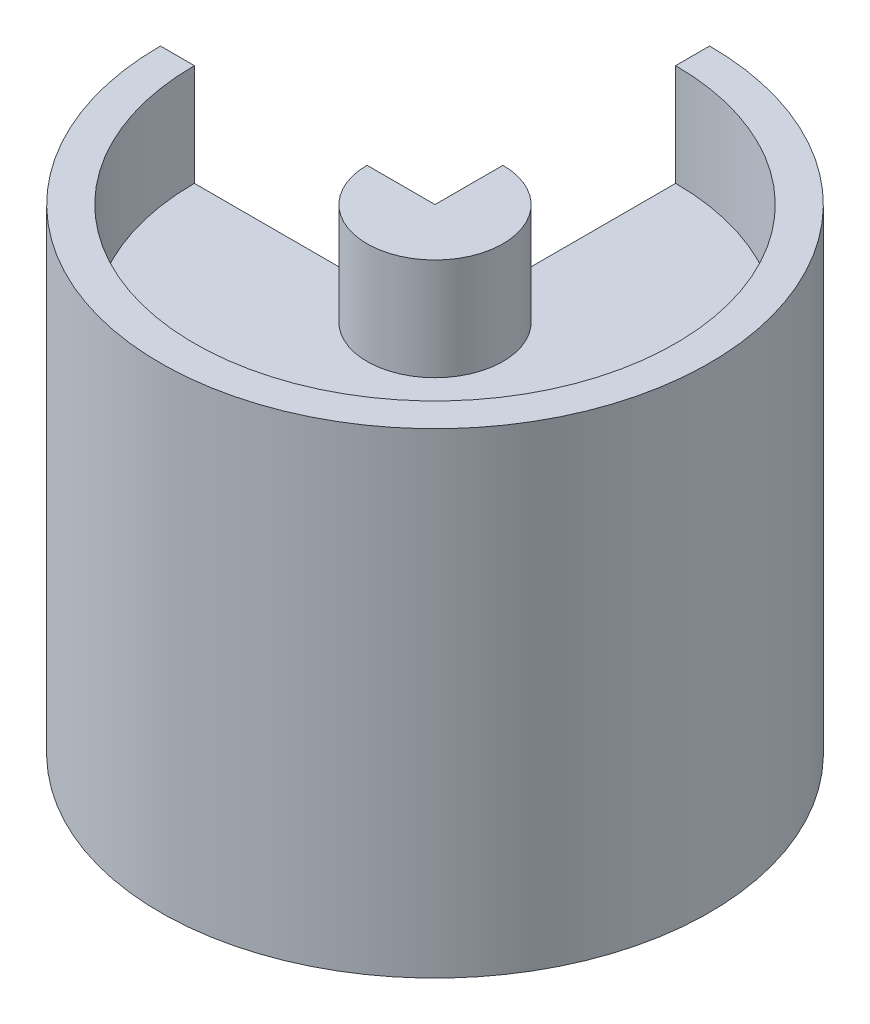
ISO-10303-21;
HEADER;
FILE_DESCRIPTION(('STEP AP214'),'2;1');
FILE_NAME('part.step','',(''),(''),'','','');
FILE_SCHEMA(('AUTOMOTIVE_DESIGN { 1 0 10303 214 1 1 1 1 }'));
ENDSEC;
DATA;
#1=APPLICATION_CONTEXT('core data for automotive mechanical design processes');
#2=APPLICATION_PROTOCOL_DEFINITION('international standard','automotive_design',2000,#1);
#3=PRODUCT_CONTEXT('',#1,'mechanical');
#4=PRODUCT('Part','Part','',(#3));
#5=PRODUCT_RELATED_PRODUCT_CATEGORY('part','',(#4));
#6=PRODUCT_DEFINITION_FORMATION('','',#4);
#7=PRODUCT_DEFINITION_CONTEXT('part definition',#1,'design');
#8=PRODUCT_DEFINITION('design','',#6,#7);
#9=PRODUCT_DEFINITION_SHAPE('','',#8);
#10=(LENGTH_UNIT() NAMED_UNIT(*) SI_UNIT(.MILLI.,.METRE.));
#11=(NAMED_UNIT(*) PLANE_ANGLE_UNIT() SI_UNIT($,.RADIAN.));
#12=(NAMED_UNIT(*) SI_UNIT($,.STERADIAN.) SOLID_ANGLE_UNIT());
#13=UNCERTAINTY_MEASURE_WITH_UNIT(LENGTH_MEASURE(1.E-05),#10,'distance_accuracy_value','');
#14=(GEOMETRIC_REPRESENTATION_CONTEXT(3) GLOBAL_UNCERTAINTY_ASSIGNED_CONTEXT((#13)) GLOBAL_UNIT_ASSIGNED_CONTEXT((#10,
#11,#12)) REPRESENTATION_CONTEXT('',''));
#15=CARTESIAN_POINT('',(0.,0.,0.));
#16=DIRECTION('',(0.,0.,1.));
#17=DIRECTION('',(1.,0.,0.));
#18=AXIS2_PLACEMENT_3D('',#15,#16,#17);
#19=CARTESIAN_POINT('',(-6.35,45.0234349741081,0.));
#20=DIRECTION('',(0.,-1.,0.));
#21=DIRECTION('',(0.,0.,-1.));
#22=AXIS2_PLACEMENT_3D('',#19,#20,#21);
#23=PLANE('',#22);
#24=DIRECTION('',(0.,0.,1.));
#25=VECTOR('',#24,1.);
#26=CARTESIAN_POINT('',(0.,45.0234349741081,-6.35));
#27=LINE('',#26,#25);
#28=CARTESIAN_POINT('',(0.,45.0234349741081,-6.35));
#29=VERTEX_POINT('',#28);
#30=CARTESIAN_POINT('',(0.,45.0234349741081,0.));
#31=VERTEX_POINT('',#30);
#32=EDGE_CURVE('E136',#29,#31,#27,.T.);
#33=ORIENTED_EDGE('',*,*,#32,.T.);
#34=DIRECTION('',(1.,0.,0.));
#35=VECTOR('',#34,1.);
#36=CARTESIAN_POINT('',(-6.35,45.0234349741081,0.));
#37=LINE('',#36,#35);
#38=CARTESIAN_POINT('',(-6.35,45.0234349741081,0.));
#39=VERTEX_POINT('',#38);
#40=EDGE_CURVE('E126',#39,#31,#37,.T.);
#41=ORIENTED_EDGE('',*,*,#40,.F.);
#42=CARTESIAN_POINT('',(0.,45.0234349741081,0.));
#43=DIRECTION('',(0.,1.,0.));
#44=DIRECTION('',(0.,0.,1.));
#45=AXIS2_PLACEMENT_3D('',#42,#43,#44);
#46=CIRCLE('',#45,6.35);
#47=EDGE_CURVE('E48',#39,#29,#46,.T.);
#48=ORIENTED_EDGE('',*,*,#47,.T.);
#49=EDGE_LOOP('',(#33,#41,#48));
#50=FACE_BOUND('',#49,.T.);
#51=ADVANCED_FACE('F33',(#50),#23,.F.);
#52=CARTESIAN_POINT('',(-3.17500000000001,0.57343497410807,0.));
#53=DIRECTION('',(0.,1.,0.));
#54=DIRECTION('',(0.,0.,1.));
#55=AXIS2_PLACEMENT_3D('',#52,#53,#54);
#56=PLANE('',#55);
#57=CARTESIAN_POINT('',(0.,0.57343497410807,0.));
#58=DIRECTION('',(0.,1.,0.));
#59=DIRECTION('',(0.,0.,1.));
#60=AXIS2_PLACEMENT_3D('',#57,#58,#59);
#61=CIRCLE('',#60,6.35);
#62=CARTESIAN_POINT('',(-6.35,0.57343497410807,0.));
#63=VERTEX_POINT('',#62);
#64=CARTESIAN_POINT('',(0.,0.57343497410807,-6.35));
#65=VERTEX_POINT('',#64);
#66=EDGE_CURVE('E11',#63,#65,#61,.T.);
#67=ORIENTED_EDGE('',*,*,#66,.F.);
#68=DIRECTION('',(-1.,0.,0.));
#69=VECTOR('',#68,1.);
#70=CARTESIAN_POINT('',(-3.17500000000001,0.57343497410807,0.));
#71=LINE('',#70,#69);
#72=CARTESIAN_POINT('',(0.,0.57343497410807,0.));
#73=VERTEX_POINT('',#72);
#74=EDGE_CURVE('E117',#73,#63,#71,.T.);
#75=ORIENTED_EDGE('',*,*,#74,.F.);
#76=DIRECTION('',(0.,0.,-1.));
#77=VECTOR('',#76,1.);
#78=CARTESIAN_POINT('',(0.,0.57343497410807,-3.17500000000001));
#79=LINE('',#78,#77);
#80=EDGE_CURVE('E119',#73,#65,#79,.T.);
#81=ORIENTED_EDGE('',*,*,#80,.T.);
#82=EDGE_LOOP('',(#67,#75,#81));
#83=FACE_BOUND('',#82,.T.);
#84=ADVANCED_FACE('F35',(#83),#56,.F.);
#85=CARTESIAN_POINT('',(0.,45.0234349741081,0.));
#86=DIRECTION('',(0.,1.,0.));
#87=DIRECTION('',(0.,0.,1.));
#88=AXIS2_PLACEMENT_3D('',#85,#86,#87);
#89=CYLINDRICAL_SURFACE('',#88,6.35);
#90=CARTESIAN_POINT('',(0.,32.3234349741081,0.));
#91=DIRECTION('',(0.,1.,0.));
#92=DIRECTION('',(0.,0.,1.));
#93=AXIS2_PLACEMENT_3D('',#90,#91,#92);
#94=CIRCLE('',#93,6.35);
#95=CARTESIAN_POINT('',(-6.35,32.3234349741081,0.));
#96=VERTEX_POINT('',#95);
#97=CARTESIAN_POINT('',(0.,32.3234349741081,-6.35));
#98=VERTEX_POINT('',#97);
#99=EDGE_CURVE('E41',#96,#98,#94,.T.);
#100=ORIENTED_EDGE('',*,*,#99,.F.);
#101=DIRECTION('',(0.,1.,0.));
#102=VECTOR('',#101,1.);
#103=CARTESIAN_POINT('',(-6.35,32.3234349741081,0.));
#104=LINE('',#103,#102);
#105=EDGE_CURVE('E125',#63,#96,#104,.T.);
#106=ORIENTED_EDGE('',*,*,#105,.F.);
#107=ORIENTED_EDGE('',*,*,#66,.T.);
#108=DIRECTION('',(0.,1.,0.));
#109=VECTOR('',#108,1.);
#110=CARTESIAN_POINT('',(0.,32.3234349741081,-6.35));
#111=LINE('',#110,#109);
#112=EDGE_CURVE('E135',#65,#98,#111,.T.);
#113=ORIENTED_EDGE('',*,*,#112,.T.);
#114=EDGE_LOOP('',(#100,#106,#107,#113));
#115=FACE_BOUND('',#114,.T.);
#116=ADVANCED_FACE('F209',(#115),#89,.T.);
#117=CARTESIAN_POINT('',(-22.479,32.3234349741081,-2.35455027047564E-13));
#118=DIRECTION('',(0.,1.,0.));
#119=DIRECTION('',(0.,0.,1.));
#120=AXIS2_PLACEMENT_3D('',#117,#118,#119);
#121=PLANE('',#120);
#122=CARTESIAN_POINT('',(0.,32.3234349741081,0.));
#123=DIRECTION('',(0.,1.,0.));
#124=DIRECTION('',(0.,0.,1.));
#125=AXIS2_PLACEMENT_3D('',#122,#123,#124);
#126=CIRCLE('',#125,22.479);
#127=CARTESIAN_POINT('',(-22.479,32.3234349741081,-2.35455027047564E-13));
#128=VERTEX_POINT('',#127);
#129=CARTESIAN_POINT('',(0.,32.3234349741081,-22.479));
#130=VERTEX_POINT('',#129);
#131=EDGE_CURVE('E203',#128,#130,#126,.T.);
#132=ORIENTED_EDGE('',*,*,#131,.F.);
#133=DIRECTION('',(-1.,0.,0.));
#134=VECTOR('',#133,1.);
#135=CARTESIAN_POINT('',(-22.479,32.3234349741081,-2.35455027047564E-13));
#136=LINE('',#135,#134);
#137=EDGE_CURVE('E169',#96,#128,#136,.T.);
#138=ORIENTED_EDGE('',*,*,#137,.F.);
#139=ORIENTED_EDGE('',*,*,#99,.T.);
#140=DIRECTION('',(0.,0.,-1.));
#141=VECTOR('',#140,1.);
#142=CARTESIAN_POINT('',(0.,32.3234349741081,-22.479));
#143=LINE('',#142,#141);
#144=EDGE_CURVE('E145',#98,#130,#143,.T.);
#145=ORIENTED_EDGE('',*,*,#144,.T.);
#146=EDGE_LOOP('',(#132,#138,#139,#145));
#147=FACE_BOUND('',#146,.T.);
#148=ADVANCED_FACE('F206',(#147),#121,.F.);
#149=CARTESIAN_POINT('',(0.,45.0234349741081,0.));
#150=DIRECTION('',(0.,1.,0.));
#151=DIRECTION('',(0.,0.,1.));
#152=AXIS2_PLACEMENT_3D('',#149,#150,#151);
#153=CYLINDRICAL_SURFACE('',#152,22.479);
#154=CARTESIAN_POINT('',(0.,0.573434974108077,0.));
#155=DIRECTION('',(0.,1.,0.));
#156=DIRECTION('',(0.,0.,1.));
#157=AXIS2_PLACEMENT_3D('',#154,#155,#156);
#158=CIRCLE('',#157,22.479);
#159=CARTESIAN_POINT('',(-22.479,0.573434974108077,-2.35455027047564E-13));
#160=VERTEX_POINT('',#159);
#161=CARTESIAN_POINT('',(0.,0.573434974108077,-22.479));
#162=VERTEX_POINT('',#161);
#163=EDGE_CURVE('E201',#160,#162,#158,.T.);
#164=ORIENTED_EDGE('',*,*,#163,.F.);
#165=DIRECTION('',(0.,-1.,0.));
#166=VECTOR('',#165,1.);
#167=CARTESIAN_POINT('',(-22.479,0.573434974108077,-2.35455027047564E-13));
#168=LINE('',#167,#166);
#169=EDGE_CURVE('E172',#128,#160,#168,.T.);
#170=ORIENTED_EDGE('',*,*,#169,.F.);
#171=ORIENTED_EDGE('',*,*,#131,.T.);
#172=DIRECTION('',(0.,-1.,0.));
#173=VECTOR('',#172,1.);
#174=CARTESIAN_POINT('',(0.,0.573434974108077,-22.479));
#175=LINE('',#174,#173);
#176=EDGE_CURVE('E148',#130,#162,#175,.T.);
#177=ORIENTED_EDGE('',*,*,#176,.T.);
#178=EDGE_LOOP('',(#164,#170,#171,#177));
#179=FACE_BOUND('',#178,.T.);
#180=ADVANCED_FACE('F213',(#179),#153,.F.);
#181=CARTESIAN_POINT('',(-25.654,0.573434974108077,-2.68711386800045E-13));
#182=DIRECTION('',(0.,1.,0.));
#183=DIRECTION('',(0.,0.,1.));
#184=AXIS2_PLACEMENT_3D('',#181,#182,#183);
#185=PLANE('',#184);
#186=CARTESIAN_POINT('',(0.,0.573434974108077,0.));
#187=DIRECTION('',(0.,1.,0.));
#188=DIRECTION('',(0.,0.,1.));
#189=AXIS2_PLACEMENT_3D('',#186,#187,#188);
#190=CIRCLE('',#189,25.654);
#191=CARTESIAN_POINT('',(-25.654,0.573434974108077,-2.68711386800045E-13));
#192=VERTEX_POINT('',#191);
#193=CARTESIAN_POINT('',(0.,0.573434974108077,-25.654));
#194=VERTEX_POINT('',#193);
#195=EDGE_CURVE('E199',#192,#194,#190,.T.);
#196=ORIENTED_EDGE('',*,*,#195,.F.);
#197=DIRECTION('',(-1.,0.,0.));
#198=VECTOR('',#197,1.);
#199=CARTESIAN_POINT('',(-25.654,0.573434974108077,-2.68711386800045E-13));
#200=LINE('',#199,#198);
#201=EDGE_CURVE('E175',#160,#192,#200,.T.);
#202=ORIENTED_EDGE('',*,*,#201,.F.);
#203=ORIENTED_EDGE('',*,*,#163,.T.);
#204=DIRECTION('',(0.,0.,-1.));
#205=VECTOR('',#204,1.);
#206=CARTESIAN_POINT('',(0.,0.573434974108077,-25.654));
#207=LINE('',#206,#205);
#208=EDGE_CURVE('E151',#162,#194,#207,.T.);
#209=ORIENTED_EDGE('',*,*,#208,.T.);
#210=EDGE_LOOP('',(#196,#202,#203,#209));
#211=FACE_BOUND('',#210,.T.);
#212=ADVANCED_FACE('F218',(#211),#185,.F.);
#213=CARTESIAN_POINT('',(0.,45.0234349741081,0.));
#214=DIRECTION('',(0.,1.,0.));
#215=DIRECTION('',(0.,0.,1.));
#216=AXIS2_PLACEMENT_3D('',#213,#214,#215);
#217=CYLINDRICAL_SURFACE('',#216,25.654);
#218=CARTESIAN_POINT('',(0.,45.0234349741081,0.));
#219=DIRECTION('',(0.,1.,0.));
#220=DIRECTION('',(0.,0.,1.));
#221=AXIS2_PLACEMENT_3D('',#218,#219,#220);
#222=CIRCLE('',#221,25.654);
#223=CARTESIAN_POINT('',(-25.654,45.0234349741081,-2.68711386800045E-13));
#224=VERTEX_POINT('',#223);
#225=CARTESIAN_POINT('',(0.,45.0234349741081,-25.654));
#226=VERTEX_POINT('',#225);
#227=EDGE_CURVE('E197',#224,#226,#222,.T.);
#228=ORIENTED_EDGE('',*,*,#227,.F.);
#229=DIRECTION('',(0.,1.,0.));
#230=VECTOR('',#229,1.);
#231=CARTESIAN_POINT('',(-25.654,45.0234349741081,-2.68711386800045E-13));
#232=LINE('',#231,#230);
#233=EDGE_CURVE('E178',#192,#224,#232,.T.);
#234=ORIENTED_EDGE('',*,*,#233,.F.);
#235=ORIENTED_EDGE('',*,*,#195,.T.);
#236=DIRECTION('',(0.,1.,0.));
#237=VECTOR('',#236,1.);
#238=CARTESIAN_POINT('',(0.,45.0234349741081,-25.654));
#239=LINE('',#238,#237);
#240=EDGE_CURVE('E154',#194,#226,#239,.T.);
#241=ORIENTED_EDGE('',*,*,#240,.T.);
#242=EDGE_LOOP('',(#228,#234,#235,#241));
#243=FACE_BOUND('',#242,.T.);
#244=ADVANCED_FACE('F220',(#243),#217,.T.);
#245=CARTESIAN_POINT('',(-22.479,45.0234349741081,-2.35455027047564E-13));
#246=DIRECTION('',(0.,-1.,0.));
#247=DIRECTION('',(0.,0.,-1.));
#248=AXIS2_PLACEMENT_3D('',#245,#246,#247);
#249=PLANE('',#248);
#250=CARTESIAN_POINT('',(0.,45.0234349741081,0.));
#251=DIRECTION('',(0.,1.,0.));
#252=DIRECTION('',(0.,0.,1.));
#253=AXIS2_PLACEMENT_3D('',#250,#251,#252);
#254=CIRCLE('',#253,22.479);
#255=CARTESIAN_POINT('',(-22.479,45.0234349741081,-2.35455027047564E-13));
#256=VERTEX_POINT('',#255);
#257=CARTESIAN_POINT('',(0.,45.0234349741081,-22.479));
#258=VERTEX_POINT('',#257);
#259=EDGE_CURVE('E195',#256,#258,#254,.T.);
#260=ORIENTED_EDGE('',*,*,#259,.F.);
#261=DIRECTION('',(1.,0.,0.));
#262=VECTOR('',#261,1.);
#263=CARTESIAN_POINT('',(-22.479,45.0234349741081,-2.35455027047564E-13));
#264=LINE('',#263,#262);
#265=EDGE_CURVE('E181',#224,#256,#264,.T.);
#266=ORIENTED_EDGE('',*,*,#265,.F.);
#267=ORIENTED_EDGE('',*,*,#227,.T.);
#268=DIRECTION('',(0.,0.,1.));
#269=VECTOR('',#268,1.);
#270=CARTESIAN_POINT('',(0.,45.0234349741081,-22.479));
#271=LINE('',#270,#269);
#272=EDGE_CURVE('E157',#226,#258,#271,.T.);
#273=ORIENTED_EDGE('',*,*,#272,.T.);
#274=EDGE_LOOP('',(#260,#266,#267,#273));
#275=FACE_BOUND('',#274,.T.);
#276=ADVANCED_FACE('F225',(#275),#249,.F.);
#277=CARTESIAN_POINT('',(0.,45.0234349741081,0.));
#278=DIRECTION('',(0.,1.,0.));
#279=DIRECTION('',(0.,0.,1.));
#280=AXIS2_PLACEMENT_3D('',#277,#278,#279);
#281=CYLINDRICAL_SURFACE('',#280,22.479);
#282=CARTESIAN_POINT('',(0.,35.4984349741081,0.));
#283=DIRECTION('',(0.,1.,0.));
#284=DIRECTION('',(0.,0.,1.));
#285=AXIS2_PLACEMENT_3D('',#282,#283,#284);
#286=CIRCLE('',#285,22.479);
#287=CARTESIAN_POINT('',(-22.479,35.4984349741081,-2.35455027047564E-13));
#288=VERTEX_POINT('',#287);
#289=CARTESIAN_POINT('',(0.,35.4984349741081,-22.479));
#290=VERTEX_POINT('',#289);
#291=EDGE_CURVE('E193',#288,#290,#286,.T.);
#292=ORIENTED_EDGE('',*,*,#291,.F.);
#293=DIRECTION('',(0.,-1.,0.));
#294=VECTOR('',#293,1.);
#295=CARTESIAN_POINT('',(-22.479,35.4984349741081,-2.35455027047564E-13));
#296=LINE('',#295,#294);
#297=EDGE_CURVE('E184',#256,#288,#296,.T.);
#298=ORIENTED_EDGE('',*,*,#297,.F.);
#299=ORIENTED_EDGE('',*,*,#259,.T.);
#300=DIRECTION('',(0.,-1.,0.));
#301=VECTOR('',#300,1.);
#302=CARTESIAN_POINT('',(0.,35.4984349741081,-22.479));
#303=LINE('',#302,#301);
#304=EDGE_CURVE('E160',#258,#290,#303,.T.);
#305=ORIENTED_EDGE('',*,*,#304,.T.);
#306=EDGE_LOOP('',(#292,#298,#299,#305));
#307=FACE_BOUND('',#306,.T.);
#308=ADVANCED_FACE('F228',(#307),#281,.F.);
#309=CARTESIAN_POINT('',(-22.479,35.4984349741081,-2.35455027047564E-13));
#310=DIRECTION('',(0.,-1.,0.));
#311=DIRECTION('',(0.,0.,-1.));
#312=AXIS2_PLACEMENT_3D('',#309,#310,#311);
#313=PLANE('',#312);
#314=CARTESIAN_POINT('',(0.,35.4984349741081,0.));
#315=DIRECTION('',(0.,1.,0.));
#316=DIRECTION('',(0.,0.,1.));
#317=AXIS2_PLACEMENT_3D('',#314,#315,#316);
#318=CIRCLE('',#317,6.35);
#319=CARTESIAN_POINT('',(-6.35,35.4984349741081,0.));
#320=VERTEX_POINT('',#319);
#321=CARTESIAN_POINT('',(0.,35.4984349741081,-6.35));
#322=VERTEX_POINT('',#321);
#323=EDGE_CURVE('E56',#320,#322,#318,.T.);
#324=ORIENTED_EDGE('',*,*,#323,.F.);
#325=DIRECTION('',(1.,0.,0.));
#326=VECTOR('',#325,1.);
#327=CARTESIAN_POINT('',(-22.479,35.4984349741081,-2.35455027047564E-13));
#328=LINE('',#327,#326);
#329=EDGE_CURVE('E187',#288,#320,#328,.T.);
#330=ORIENTED_EDGE('',*,*,#329,.F.);
#331=ORIENTED_EDGE('',*,*,#291,.T.);
#332=DIRECTION('',(0.,0.,1.));
#333=VECTOR('',#332,1.);
#334=CARTESIAN_POINT('',(0.,35.4984349741081,-22.479));
#335=LINE('',#334,#333);
#336=EDGE_CURVE('E163',#290,#322,#335,.T.);
#337=ORIENTED_EDGE('',*,*,#336,.T.);
#338=EDGE_LOOP('',(#324,#330,#331,#337));
#339=FACE_BOUND('',#338,.T.);
#340=ADVANCED_FACE('F230',(#339),#313,.F.);
#341=CARTESIAN_POINT('',(0.,45.0234349741081,0.));
#342=DIRECTION('',(0.,1.,0.));
#343=DIRECTION('',(0.,0.,1.));
#344=AXIS2_PLACEMENT_3D('',#341,#342,#343);
#345=CYLINDRICAL_SURFACE('',#344,6.35);
#346=DIRECTION('',(0.,1.,0.));
#347=VECTOR('',#346,1.);
#348=CARTESIAN_POINT('',(-6.35,35.4984349741081,0.));
#349=LINE('',#348,#347);
#350=EDGE_CURVE('E189',#320,#39,#349,.T.);
#351=ORIENTED_EDGE('',*,*,#350,.F.);
#352=ORIENTED_EDGE('',*,*,#323,.T.);
#353=DIRECTION('',(0.,1.,0.));
#354=VECTOR('',#353,1.);
#355=CARTESIAN_POINT('',(0.,35.4984349741081,-6.35));
#356=LINE('',#355,#354);
#357=EDGE_CURVE('E165',#322,#29,#356,.T.);
#358=ORIENTED_EDGE('',*,*,#357,.T.);
#359=ORIENTED_EDGE('',*,*,#47,.F.);
#360=EDGE_LOOP('',(#351,#352,#358,#359));
#361=FACE_BOUND('',#360,.T.);
#362=ADVANCED_FACE('F232',(#361),#345,.T.);
#363=CARTESIAN_POINT('',(0.,0.,0.));
#364=DIRECTION('',(0.,0.,-1.));
#365=DIRECTION('',(-1.,0.,0.));
#366=AXIS2_PLACEMENT_3D('',#363,#364,#365);
#367=PLANE('',#366);
#368=ORIENTED_EDGE('',*,*,#329,.T.);
#369=ORIENTED_EDGE('',*,*,#350,.T.);
#370=ORIENTED_EDGE('',*,*,#40,.T.);
#371=DIRECTION('',(0.,1.,0.));
#372=VECTOR('',#371,1.);
#373=CARTESIAN_POINT('',(0.,0.57343497410807,0.));
#374=LINE('',#373,#372);
#375=EDGE_CURVE('E133',#73,#31,#374,.T.);
#376=ORIENTED_EDGE('',*,*,#375,.F.);
#377=ORIENTED_EDGE('',*,*,#74,.T.);
#378=ORIENTED_EDGE('',*,*,#105,.T.);
#379=ORIENTED_EDGE('',*,*,#137,.T.);
#380=ORIENTED_EDGE('',*,*,#169,.T.);
#381=ORIENTED_EDGE('',*,*,#201,.T.);
#382=ORIENTED_EDGE('',*,*,#233,.T.);
#383=ORIENTED_EDGE('',*,*,#265,.T.);
#384=ORIENTED_EDGE('',*,*,#297,.T.);
#385=EDGE_LOOP('',(#368,#369,#370,#376,#377,#378,#379,#380,#381,#382,#383,#384));
#386=FACE_BOUND('',#385,.T.);
#387=ADVANCED_FACE('F138',(#386),#367,.T.);
#388=CARTESIAN_POINT('',(0.,0.,0.));
#389=DIRECTION('',(1.,0.,0.));
#390=DIRECTION('',(0.,0.,-1.));
#391=AXIS2_PLACEMENT_3D('',#388,#389,#390);
#392=PLANE('',#391);
#393=ORIENTED_EDGE('',*,*,#144,.F.);
#394=ORIENTED_EDGE('',*,*,#112,.F.);
#395=ORIENTED_EDGE('',*,*,#80,.F.);
#396=ORIENTED_EDGE('',*,*,#375,.T.);
#397=ORIENTED_EDGE('',*,*,#32,.F.);
#398=ORIENTED_EDGE('',*,*,#357,.F.);
#399=ORIENTED_EDGE('',*,*,#336,.F.);
#400=ORIENTED_EDGE('',*,*,#304,.F.);
#401=ORIENTED_EDGE('',*,*,#272,.F.);
#402=ORIENTED_EDGE('',*,*,#240,.F.);
#403=ORIENTED_EDGE('',*,*,#208,.F.);
#404=ORIENTED_EDGE('',*,*,#176,.F.);
#405=EDGE_LOOP('',(#393,#394,#395,#396,#397,#398,#399,#400,#401,#402,#403,#404));
#406=FACE_BOUND('',#405,.T.);
#407=ADVANCED_FACE('F131',(#406),#392,.F.);
#408=CLOSED_SHELL('',(#51,#84,#116,#148,#180,#212,#244,#276,#308,#340,#362,#387,#407));
#409=MANIFOLD_SOLID_BREP('B2',#408);
#410=ADVANCED_BREP_SHAPE_REPRESENTATION('',(#18,#409),#14);
#411=SHAPE_DEFINITION_REPRESENTATION(#9,#410);
ENDSEC;
END-ISO-10303-21;
